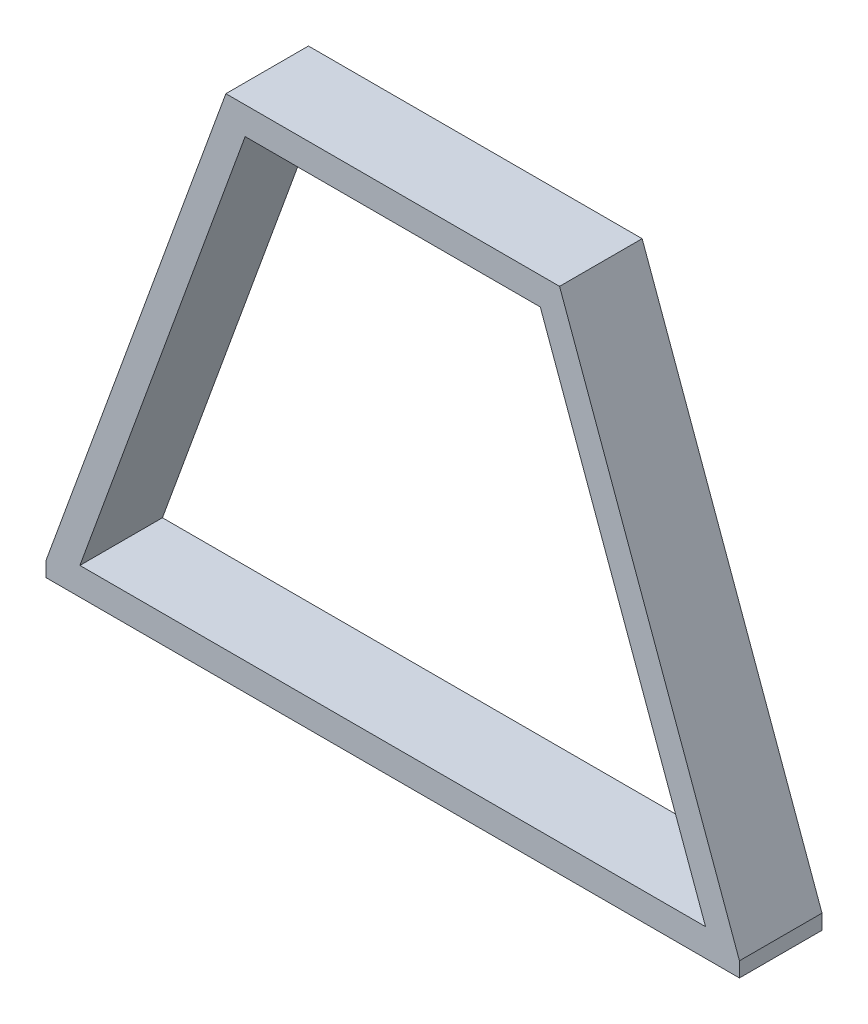
ISO-10303-21;
HEADER;
FILE_DESCRIPTION(('STEP AP214'),'2;1');
FILE_NAME('part.step','',(''),(''),'','','');
FILE_SCHEMA(('AUTOMOTIVE_DESIGN { 1 0 10303 214 1 1 1 1 }'));
ENDSEC;
DATA;
#1=APPLICATION_CONTEXT('core data for automotive mechanical design processes');
#2=APPLICATION_PROTOCOL_DEFINITION('international standard','automotive_design',2000,#1);
#3=PRODUCT_CONTEXT('',#1,'mechanical');
#4=PRODUCT('Part','Part','',(#3));
#5=PRODUCT_RELATED_PRODUCT_CATEGORY('part','',(#4));
#6=PRODUCT_DEFINITION_FORMATION('','',#4);
#7=PRODUCT_DEFINITION_CONTEXT('part definition',#1,'design');
#8=PRODUCT_DEFINITION('design','',#6,#7);
#9=PRODUCT_DEFINITION_SHAPE('','',#8);
#10=(LENGTH_UNIT() NAMED_UNIT(*) SI_UNIT(.MILLI.,.METRE.));
#11=(NAMED_UNIT(*) PLANE_ANGLE_UNIT() SI_UNIT($,.RADIAN.));
#12=(NAMED_UNIT(*) SI_UNIT($,.STERADIAN.) SOLID_ANGLE_UNIT());
#13=UNCERTAINTY_MEASURE_WITH_UNIT(LENGTH_MEASURE(1.E-05),#10,'distance_accuracy_value','');
#14=(GEOMETRIC_REPRESENTATION_CONTEXT(3) GLOBAL_UNCERTAINTY_ASSIGNED_CONTEXT((#13)) GLOBAL_UNIT_ASSIGNED_CONTEXT((#10,
#11,#12)) REPRESENTATION_CONTEXT('',''));
#15=CARTESIAN_POINT('',(0.,0.,0.));
#16=DIRECTION('',(0.,0.,1.));
#17=DIRECTION('',(1.,0.,0.));
#18=AXIS2_PLACEMENT_3D('',#15,#16,#17);
#19=CARTESIAN_POINT('',(0.,0.,76.2));
#20=DIRECTION('',(0.,0.,-1.));
#21=DIRECTION('',(-1.,0.,0.));
#22=AXIS2_PLACEMENT_3D('',#19,#20,#21);
#23=PLANE('',#22);
#24=DIRECTION('',(1.,0.,0.));
#25=VECTOR('',#24,1.);
#26=CARTESIAN_POINT('',(0.,0.,76.2));
#27=LINE('',#26,#25);
#28=CARTESIAN_POINT('',(5.,0.,76.2));
#29=VERTEX_POINT('',#28);
#30=CARTESIAN_POINT('',(645.,0.,76.2));
#31=VERTEX_POINT('',#30);
#32=EDGE_CURVE('E123',#29,#31,#27,.T.);
#33=ORIENTED_EDGE('',*,*,#32,.T.);
#34=DIRECTION('',(0.,-1.,0.));
#35=VECTOR('',#34,1.);
#36=CARTESIAN_POINT('',(645.,76.2,76.2));
#37=LINE('',#36,#35);
#38=CARTESIAN_POINT('',(645.,13.7373870972731,76.2));
#39=VERTEX_POINT('',#38);
#40=EDGE_CURVE('E111',#39,#31,#37,.T.);
#41=ORIENTED_EDGE('',*,*,#40,.F.);
#42=DIRECTION('',(-0.342020143325673,0.939692620785907,0.));
#43=VECTOR('',#42,1.);
#44=CARTESIAN_POINT('',(650.,0.,76.2));
#45=LINE('',#44,#43);
#46=CARTESIAN_POINT('',(478.989928337163,469.846310392955,76.2));
#47=VERTEX_POINT('',#46);
#48=EDGE_CURVE('E131',#39,#47,#45,.T.);
#49=ORIENTED_EDGE('',*,*,#48,.T.);
#50=DIRECTION('',(-1.,0.,0.));
#51=VECTOR('',#50,1.);
#52=CARTESIAN_POINT('',(171.010071662833,469.846310392955,76.2));
#53=LINE('',#52,#51);
#54=CARTESIAN_POINT('',(171.010071662833,469.846310392955,76.2));
#55=VERTEX_POINT('',#54);
#56=EDGE_CURVE('E134',#47,#55,#53,.T.);
#57=ORIENTED_EDGE('',*,*,#56,.T.);
#58=DIRECTION('',(-0.342020143325666,-0.93969262078591,0.));
#59=VECTOR('',#58,1.);
#60=CARTESIAN_POINT('',(0.,0.,76.2));
#61=LINE('',#60,#59);
#62=CARTESIAN_POINT('',(5.,13.7373870972733,76.2));
#63=VERTEX_POINT('',#62);
#64=EDGE_CURVE('E132',#55,#63,#61,.T.);
#65=ORIENTED_EDGE('',*,*,#64,.T.);
#66=DIRECTION('',(0.,-1.,0.));
#67=VECTOR('',#66,1.);
#68=CARTESIAN_POINT('',(5.,76.2,76.2));
#69=LINE('',#68,#67);
#70=EDGE_CURVE('E130',#63,#29,#69,.T.);
#71=ORIENTED_EDGE('',*,*,#70,.T.);
#72=EDGE_LOOP('',(#33,#41,#49,#57,#65,#71));
#73=FACE_BOUND('',#72,.T.);
#74=DIRECTION('',(-0.342020143325666,-0.93969262078591,0.));
#75=VECTOR('',#74,1.);
#76=CARTESIAN_POINT('',(36.2749593712496,25.4,76.2));
#77=LINE('',#76,#75);
#78=CARTESIAN_POINT('',(188.79534313336,444.446310392955,76.2));
#79=VERTEX_POINT('',#78);
#80=CARTESIAN_POINT('',(36.2749593712496,25.4,76.2));
#81=VERTEX_POINT('',#80);
#82=EDGE_CURVE('E282',#79,#81,#77,.T.);
#83=ORIENTED_EDGE('',*,*,#82,.F.);
#84=DIRECTION('',(-1.,0.,0.));
#85=VECTOR('',#84,1.);
#86=CARTESIAN_POINT('',(188.79534313336,444.446310392955,76.2));
#87=LINE('',#86,#85);
#88=CARTESIAN_POINT('',(461.204656866637,444.446310392955,76.2));
#89=VERTEX_POINT('',#88);
#90=EDGE_CURVE('E295',#89,#79,#87,.T.);
#91=ORIENTED_EDGE('',*,*,#90,.F.);
#92=DIRECTION('',(-0.342020143325673,0.939692620785907,0.));
#93=VECTOR('',#92,1.);
#94=CARTESIAN_POINT('',(613.72504062875,25.4,76.2));
#95=LINE('',#94,#93);
#96=CARTESIAN_POINT('',(613.72504062875,25.4,76.2));
#97=VERTEX_POINT('',#96);
#98=EDGE_CURVE('E305',#97,#89,#95,.T.);
#99=ORIENTED_EDGE('',*,*,#98,.F.);
#100=DIRECTION('',(1.,0.,0.));
#101=VECTOR('',#100,1.);
#102=CARTESIAN_POINT('',(36.2749593712496,25.4,76.2));
#103=LINE('',#102,#101);
#104=EDGE_CURVE('E307',#81,#97,#103,.T.);
#105=ORIENTED_EDGE('',*,*,#104,.F.);
#106=EDGE_LOOP('',(#83,#91,#99,#105));
#107=FACE_BOUND('',#106,.T.);
#108=ADVANCED_FACE('F37',(#73,#107),#23,.F.);
#109=CARTESIAN_POINT('',(0.,0.,0.));
#110=DIRECTION('',(0.,0.,-1.));
#111=DIRECTION('',(-1.,0.,0.));
#112=AXIS2_PLACEMENT_3D('',#109,#110,#111);
#113=PLANE('',#112);
#114=DIRECTION('',(0.,-1.,0.));
#115=VECTOR('',#114,1.);
#116=CARTESIAN_POINT('',(645.,76.2,0.));
#117=LINE('',#116,#115);
#118=CARTESIAN_POINT('',(645.,13.7373870972729,0.));
#119=VERTEX_POINT('',#118);
#120=CARTESIAN_POINT('',(645.,0.,0.));
#121=VERTEX_POINT('',#120);
#122=EDGE_CURVE('E52',#119,#121,#117,.T.);
#123=ORIENTED_EDGE('',*,*,#122,.T.);
#124=DIRECTION('',(1.,0.,0.));
#125=VECTOR('',#124,1.);
#126=CARTESIAN_POINT('',(0.,0.,0.));
#127=LINE('',#126,#125);
#128=CARTESIAN_POINT('',(5.00000000000001,0.,0.));
#129=VERTEX_POINT('',#128);
#130=EDGE_CURVE('E125',#129,#121,#127,.T.);
#131=ORIENTED_EDGE('',*,*,#130,.F.);
#132=DIRECTION('',(0.,-1.,0.));
#133=VECTOR('',#132,1.);
#134=CARTESIAN_POINT('',(5.00000000000001,76.2,0.));
#135=LINE('',#134,#133);
#136=CARTESIAN_POINT('',(5.00000000000004,13.7373870972734,0.));
#137=VERTEX_POINT('',#136);
#138=EDGE_CURVE('E59',#137,#129,#135,.T.);
#139=ORIENTED_EDGE('',*,*,#138,.F.);
#140=DIRECTION('',(-0.342020143325666,-0.93969262078591,0.));
#141=VECTOR('',#140,1.);
#142=CARTESIAN_POINT('',(0.,0.,0.));
#143=LINE('',#142,#141);
#144=CARTESIAN_POINT('',(171.010071662833,469.846310392955,0.));
#145=VERTEX_POINT('',#144);
#146=EDGE_CURVE('E142',#145,#137,#143,.T.);
#147=ORIENTED_EDGE('',*,*,#146,.F.);
#148=DIRECTION('',(-1.,0.,0.));
#149=VECTOR('',#148,1.);
#150=CARTESIAN_POINT('',(171.010071662833,469.846310392955,0.));
#151=LINE('',#150,#149);
#152=CARTESIAN_POINT('',(478.989928337163,469.846310392955,0.));
#153=VERTEX_POINT('',#152);
#154=EDGE_CURVE('E136',#153,#145,#151,.T.);
#155=ORIENTED_EDGE('',*,*,#154,.F.);
#156=DIRECTION('',(-0.342020143325673,0.939692620785907,0.));
#157=VECTOR('',#156,1.);
#158=CARTESIAN_POINT('',(650.,0.,0.));
#159=LINE('',#158,#157);
#160=EDGE_CURVE('E147',#119,#153,#159,.T.);
#161=ORIENTED_EDGE('',*,*,#160,.F.);
#162=EDGE_LOOP('',(#123,#131,#139,#147,#155,#161));
#163=FACE_BOUND('',#162,.T.);
#164=DIRECTION('',(-1.,0.,0.));
#165=VECTOR('',#164,1.);
#166=CARTESIAN_POINT('',(188.79534313336,444.446310392955,0.));
#167=LINE('',#166,#165);
#168=CARTESIAN_POINT('',(461.204656866637,444.446310392955,0.));
#169=VERTEX_POINT('',#168);
#170=CARTESIAN_POINT('',(188.79534313336,444.446310392955,0.));
#171=VERTEX_POINT('',#170);
#172=EDGE_CURVE('E275',#169,#171,#167,.T.);
#173=ORIENTED_EDGE('',*,*,#172,.T.);
#174=DIRECTION('',(-0.342020143325666,-0.93969262078591,0.));
#175=VECTOR('',#174,1.);
#176=CARTESIAN_POINT('',(36.2749593712496,25.4,0.));
#177=LINE('',#176,#175);
#178=CARTESIAN_POINT('',(36.2749593712496,25.4,0.));
#179=VERTEX_POINT('',#178);
#180=EDGE_CURVE('E290',#171,#179,#177,.T.);
#181=ORIENTED_EDGE('',*,*,#180,.T.);
#182=DIRECTION('',(1.,0.,0.));
#183=VECTOR('',#182,1.);
#184=CARTESIAN_POINT('',(36.2749593712496,25.4,0.));
#185=LINE('',#184,#183);
#186=CARTESIAN_POINT('',(613.72504062875,25.4,0.));
#187=VERTEX_POINT('',#186);
#188=EDGE_CURVE('E287',#179,#187,#185,.T.);
#189=ORIENTED_EDGE('',*,*,#188,.T.);
#190=DIRECTION('',(-0.342020143325673,0.939692620785907,0.));
#191=VECTOR('',#190,1.);
#192=CARTESIAN_POINT('',(613.72504062875,25.4,0.));
#193=LINE('',#192,#191);
#194=EDGE_CURVE('E283',#187,#169,#193,.T.);
#195=ORIENTED_EDGE('',*,*,#194,.T.);
#196=EDGE_LOOP('',(#173,#181,#189,#195));
#197=FACE_BOUND('',#196,.T.);
#198=ADVANCED_FACE('F162',(#163,#197),#113,.T.);
#199=CARTESIAN_POINT('',(0.,0.,76.2));
#200=DIRECTION('',(0.93969262078591,-0.342020143325666,0.));
#201=DIRECTION('',(0.342020143325666,0.93969262078591,0.));
#202=AXIS2_PLACEMENT_3D('',#199,#200,#201);
#203=PLANE('',#202);
#204=ORIENTED_EDGE('',*,*,#146,.T.);
#205=DIRECTION('',(0.,0.,1.));
#206=VECTOR('',#205,1.);
#207=CARTESIAN_POINT('',(5.,13.7373870972733,76.2));
#208=LINE('',#207,#206);
#209=EDGE_CURVE('E167',#137,#63,#208,.T.);
#210=ORIENTED_EDGE('',*,*,#209,.T.);
#211=ORIENTED_EDGE('',*,*,#64,.F.);
#212=DIRECTION('',(0.,0.,-1.));
#213=VECTOR('',#212,1.);
#214=CARTESIAN_POINT('',(171.010071662833,469.846310392955,76.2));
#215=LINE('',#214,#213);
#216=EDGE_CURVE('E141',#55,#145,#215,.T.);
#217=ORIENTED_EDGE('',*,*,#216,.T.);
#218=EDGE_LOOP('',(#204,#210,#211,#217));
#219=FACE_BOUND('',#218,.T.);
#220=ADVANCED_FACE('F39',(#219),#203,.F.);
#221=CARTESIAN_POINT('',(0.,0.,76.2));
#222=DIRECTION('',(0.,1.,0.));
#223=DIRECTION('',(0.,0.,1.));
#224=AXIS2_PLACEMENT_3D('',#221,#222,#223);
#225=PLANE('',#224);
#226=ORIENTED_EDGE('',*,*,#130,.T.);
#227=DIRECTION('',(0.,0.,-1.));
#228=VECTOR('',#227,1.);
#229=CARTESIAN_POINT('',(645.,0.,76.2));
#230=LINE('',#229,#228);
#231=EDGE_CURVE('E114',#31,#121,#230,.T.);
#232=ORIENTED_EDGE('',*,*,#231,.F.);
#233=ORIENTED_EDGE('',*,*,#32,.F.);
#234=DIRECTION('',(0.,0.,1.));
#235=VECTOR('',#234,1.);
#236=CARTESIAN_POINT('',(5.,0.,76.2));
#237=LINE('',#236,#235);
#238=EDGE_CURVE('E311',#129,#29,#237,.T.);
#239=ORIENTED_EDGE('',*,*,#238,.F.);
#240=EDGE_LOOP('',(#226,#232,#233,#239));
#241=FACE_BOUND('',#240,.T.);
#242=ADVANCED_FACE('F122',(#241),#225,.F.);
#243=CARTESIAN_POINT('',(650.,0.,76.2));
#244=DIRECTION('',(-0.939692620785907,-0.342020143325673,0.));
#245=DIRECTION('',(0.342020143325673,-0.939692620785907,0.));
#246=AXIS2_PLACEMENT_3D('',#243,#244,#245);
#247=PLANE('',#246);
#248=ORIENTED_EDGE('',*,*,#48,.F.);
#249=DIRECTION('',(0.,0.,-1.));
#250=VECTOR('',#249,1.);
#251=CARTESIAN_POINT('',(645.,13.7373870972729,76.2));
#252=LINE('',#251,#250);
#253=EDGE_CURVE('E11',#39,#119,#252,.T.);
#254=ORIENTED_EDGE('',*,*,#253,.T.);
#255=ORIENTED_EDGE('',*,*,#160,.T.);
#256=DIRECTION('',(0.,0.,-1.));
#257=VECTOR('',#256,1.);
#258=CARTESIAN_POINT('',(478.989928337163,469.846310392955,76.2));
#259=LINE('',#258,#257);
#260=EDGE_CURVE('E45',#47,#153,#259,.T.);
#261=ORIENTED_EDGE('',*,*,#260,.F.);
#262=EDGE_LOOP('',(#248,#254,#255,#261));
#263=FACE_BOUND('',#262,.T.);
#264=ADVANCED_FACE('F168',(#263),#247,.F.);
#265=CARTESIAN_POINT('',(171.010071662833,469.846310392955,76.2));
#266=DIRECTION('',(0.,-1.,0.));
#267=DIRECTION('',(0.,0.,-1.));
#268=AXIS2_PLACEMENT_3D('',#265,#266,#267);
#269=PLANE('',#268);
#270=ORIENTED_EDGE('',*,*,#154,.T.);
#271=ORIENTED_EDGE('',*,*,#216,.F.);
#272=ORIENTED_EDGE('',*,*,#56,.F.);
#273=ORIENTED_EDGE('',*,*,#260,.T.);
#274=EDGE_LOOP('',(#270,#271,#272,#273));
#275=FACE_BOUND('',#274,.T.);
#276=ADVANCED_FACE('F156',(#275),#269,.F.);
#277=CARTESIAN_POINT('',(36.2749593712496,25.4,76.2));
#278=DIRECTION('',(0.93969262078591,-0.342020143325666,0.));
#279=DIRECTION('',(0.342020143325666,0.93969262078591,0.));
#280=AXIS2_PLACEMENT_3D('',#277,#278,#279);
#281=PLANE('',#280);
#282=ORIENTED_EDGE('',*,*,#180,.F.);
#283=DIRECTION('',(0.,0.,-1.));
#284=VECTOR('',#283,1.);
#285=CARTESIAN_POINT('',(188.79534313336,444.446310392955,76.2));
#286=LINE('',#285,#284);
#287=EDGE_CURVE('E280',#79,#171,#286,.T.);
#288=ORIENTED_EDGE('',*,*,#287,.F.);
#289=ORIENTED_EDGE('',*,*,#82,.T.);
#290=DIRECTION('',(0.,0.,-1.));
#291=VECTOR('',#290,1.);
#292=CARTESIAN_POINT('',(36.2749593712496,25.4,76.2));
#293=LINE('',#292,#291);
#294=EDGE_CURVE('E145',#81,#179,#293,.T.);
#295=ORIENTED_EDGE('',*,*,#294,.T.);
#296=EDGE_LOOP('',(#282,#288,#289,#295));
#297=FACE_BOUND('',#296,.T.);
#298=ADVANCED_FACE('F175',(#297),#281,.T.);
#299=CARTESIAN_POINT('',(36.2749593712496,25.4,76.2));
#300=DIRECTION('',(0.,1.,0.));
#301=DIRECTION('',(0.,0.,1.));
#302=AXIS2_PLACEMENT_3D('',#299,#300,#301);
#303=PLANE('',#302);
#304=ORIENTED_EDGE('',*,*,#188,.F.);
#305=ORIENTED_EDGE('',*,*,#294,.F.);
#306=ORIENTED_EDGE('',*,*,#104,.T.);
#307=DIRECTION('',(0.,0.,-1.));
#308=VECTOR('',#307,1.);
#309=CARTESIAN_POINT('',(613.72504062875,25.4,76.2));
#310=LINE('',#309,#308);
#311=EDGE_CURVE('E297',#97,#187,#310,.T.);
#312=ORIENTED_EDGE('',*,*,#311,.T.);
#313=EDGE_LOOP('',(#304,#305,#306,#312));
#314=FACE_BOUND('',#313,.T.);
#315=ADVANCED_FACE('F186',(#314),#303,.T.);
#316=CARTESIAN_POINT('',(613.72504062875,25.4,76.2));
#317=DIRECTION('',(-0.939692620785907,-0.342020143325673,0.));
#318=DIRECTION('',(0.342020143325673,-0.939692620785907,0.));
#319=AXIS2_PLACEMENT_3D('',#316,#317,#318);
#320=PLANE('',#319);
#321=ORIENTED_EDGE('',*,*,#194,.F.);
#322=ORIENTED_EDGE('',*,*,#311,.F.);
#323=ORIENTED_EDGE('',*,*,#98,.T.);
#324=DIRECTION('',(0.,0.,-1.));
#325=VECTOR('',#324,1.);
#326=CARTESIAN_POINT('',(461.204656866637,444.446310392955,76.2));
#327=LINE('',#326,#325);
#328=EDGE_CURVE('E277',#89,#169,#327,.T.);
#329=ORIENTED_EDGE('',*,*,#328,.T.);
#330=EDGE_LOOP('',(#321,#322,#323,#329));
#331=FACE_BOUND('',#330,.T.);
#332=ADVANCED_FACE('F190',(#331),#320,.T.);
#333=CARTESIAN_POINT('',(188.79534313336,444.446310392955,76.2));
#334=DIRECTION('',(0.,-1.,0.));
#335=DIRECTION('',(0.,0.,-1.));
#336=AXIS2_PLACEMENT_3D('',#333,#334,#335);
#337=PLANE('',#336);
#338=ORIENTED_EDGE('',*,*,#172,.F.);
#339=ORIENTED_EDGE('',*,*,#328,.F.);
#340=ORIENTED_EDGE('',*,*,#90,.T.);
#341=ORIENTED_EDGE('',*,*,#287,.T.);
#342=EDGE_LOOP('',(#338,#339,#340,#341));
#343=FACE_BOUND('',#342,.T.);
#344=ADVANCED_FACE('F194',(#343),#337,.T.);
#345=CARTESIAN_POINT('',(5.,76.2,76.2));
#346=DIRECTION('',(1.,0.,0.));
#347=DIRECTION('',(0.,0.,-1.));
#348=AXIS2_PLACEMENT_3D('',#345,#346,#347);
#349=PLANE('',#348);
#350=ORIENTED_EDGE('',*,*,#138,.T.);
#351=ORIENTED_EDGE('',*,*,#238,.T.);
#352=ORIENTED_EDGE('',*,*,#70,.F.);
#353=ORIENTED_EDGE('',*,*,#209,.F.);
#354=EDGE_LOOP('',(#350,#351,#352,#353));
#355=FACE_BOUND('',#354,.T.);
#356=ADVANCED_FACE('F198',(#355),#349,.F.);
#357=CARTESIAN_POINT('',(645.,76.2,76.2));
#358=DIRECTION('',(-1.,0.,0.));
#359=DIRECTION('',(0.,0.,1.));
#360=AXIS2_PLACEMENT_3D('',#357,#358,#359);
#361=PLANE('',#360);
#362=ORIENTED_EDGE('',*,*,#40,.T.);
#363=ORIENTED_EDGE('',*,*,#231,.T.);
#364=ORIENTED_EDGE('',*,*,#122,.F.);
#365=ORIENTED_EDGE('',*,*,#253,.F.);
#366=EDGE_LOOP('',(#362,#363,#364,#365));
#367=FACE_BOUND('',#366,.T.);
#368=ADVANCED_FACE('F113',(#367),#361,.F.);
#369=CLOSED_SHELL('',(#108,#198,#220,#242,#264,#276,#298,#315,#332,#344,#356,#368));
#370=MANIFOLD_SOLID_BREP('B2',#369);
#371=ADVANCED_BREP_SHAPE_REPRESENTATION('',(#18,#370),#14);
#372=SHAPE_DEFINITION_REPRESENTATION(#9,#371);
ENDSEC;
END-ISO-10303-21;
